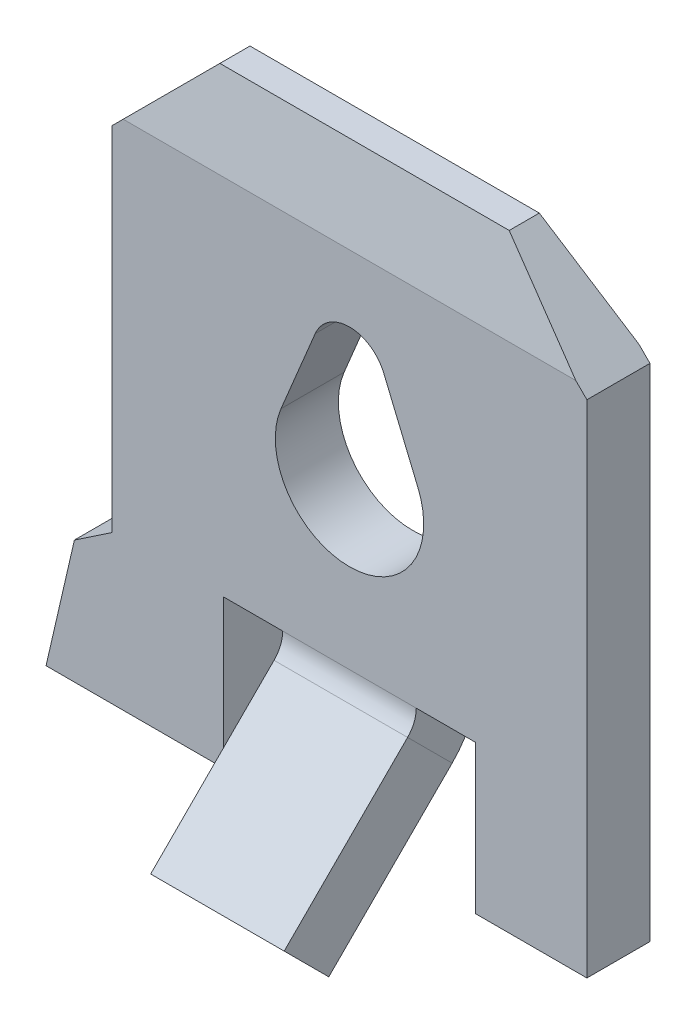
ISO-10303-21;
HEADER;
FILE_DESCRIPTION(('STEP AP214'),'2;1');
FILE_NAME('part.step','',(''),(''),'','','');
FILE_SCHEMA(('AUTOMOTIVE_DESIGN { 1 0 10303 214 1 1 1 1 }'));
ENDSEC;
DATA;
#1=APPLICATION_CONTEXT('core data for automotive mechanical design processes');
#2=APPLICATION_PROTOCOL_DEFINITION('international standard','automotive_design',2000,#1);
#3=PRODUCT_CONTEXT('',#1,'mechanical');
#4=PRODUCT('Part','Part','',(#3));
#5=PRODUCT_RELATED_PRODUCT_CATEGORY('part','',(#4));
#6=PRODUCT_DEFINITION_FORMATION('','',#4);
#7=PRODUCT_DEFINITION_CONTEXT('part definition',#1,'design');
#8=PRODUCT_DEFINITION('design','',#6,#7);
#9=PRODUCT_DEFINITION_SHAPE('','',#8);
#10=(LENGTH_UNIT() NAMED_UNIT(*) SI_UNIT(.MILLI.,.METRE.));
#11=(NAMED_UNIT(*) PLANE_ANGLE_UNIT() SI_UNIT($,.RADIAN.));
#12=(NAMED_UNIT(*) SI_UNIT($,.STERADIAN.) SOLID_ANGLE_UNIT());
#13=UNCERTAINTY_MEASURE_WITH_UNIT(LENGTH_MEASURE(1.E-05),#10,'distance_accuracy_value','');
#14=(GEOMETRIC_REPRESENTATION_CONTEXT(3) GLOBAL_UNCERTAINTY_ASSIGNED_CONTEXT((#13)) GLOBAL_UNIT_ASSIGNED_CONTEXT((#10,
#11,#12)) REPRESENTATION_CONTEXT('',''));
#15=CARTESIAN_POINT('',(0.,0.,0.));
#16=DIRECTION('',(0.,0.,1.));
#17=DIRECTION('',(1.,0.,0.));
#18=AXIS2_PLACEMENT_3D('',#15,#16,#17);
#19=CARTESIAN_POINT('',(6.4,0.149999999999999,0.));
#20=DIRECTION('',(0.,0.,1.));
#21=DIRECTION('',(0.,-1.,0.));
#22=AXIS2_PLACEMENT_3D('',#19,#20,#21);
#23=PLANE('',#22);
#24=DIRECTION('',(0.384813689288075,-0.922994271128755,0.));
#25=VECTOR('',#24,1.);
#26=CARTESIAN_POINT('',(3.66743697464802,5.82748992853653,0.));
#27=LINE('',#26,#25);
#28=CARTESIAN_POINT('',(3.66743697464802,5.82748992853653,0.));
#29=VERTEX_POINT('',#28);
#30=CARTESIAN_POINT('',(4.12299427112875,4.73481368928808,0.));
#31=VERTEX_POINT('',#30);
#32=EDGE_CURVE('E308',#29,#31,#27,.T.);
#33=ORIENTED_EDGE('',*,*,#32,.F.);
#34=CARTESIAN_POINT('',(3.2,5.65,0.));
#35=DIRECTION('',(0.,0.,1.));
#36=DIRECTION('',(0.,-1.,0.));
#37=AXIS2_PLACEMENT_3D('',#34,#35,#36);
#38=CIRCLE('',#37,0.5);
#39=CARTESIAN_POINT('',(2.73846153846154,5.84230769230769,0.));
#40=VERTEX_POINT('',#39);
#41=EDGE_CURVE('E311',#40,#29,#38,.F.);
#42=ORIENTED_EDGE('',*,*,#41,.F.);
#43=DIRECTION('',(0.384615384615385,0.923076923076923,0.));
#44=VECTOR('',#43,1.);
#45=CARTESIAN_POINT('',(2.73846153846154,5.84230769230769,0.));
#46=LINE('',#45,#44);
#47=CARTESIAN_POINT('',(2.27692307692308,4.73461538461538,0.));
#48=VERTEX_POINT('',#47);
#49=EDGE_CURVE('E313',#48,#40,#46,.T.);
#50=ORIENTED_EDGE('',*,*,#49,.F.);
#51=CARTESIAN_POINT('',(3.2,4.35,0.));
#52=DIRECTION('',(0.,0.,1.));
#53=DIRECTION('',(0.,-1.,0.));
#54=AXIS2_PLACEMENT_3D('',#51,#52,#53);
#55=CIRCLE('',#54,0.999999999999999);
#56=EDGE_CURVE('E305',#31,#48,#55,.F.);
#57=ORIENTED_EDGE('',*,*,#56,.F.);
#58=EDGE_LOOP('',(#33,#42,#50,#57));
#59=FACE_BOUND('',#58,.T.);
#60=DIRECTION('',(1.,0.,0.));
#61=VECTOR('',#60,1.);
#62=CARTESIAN_POINT('',(4.1,2.15,0.));
#63=LINE('',#62,#61);
#64=CARTESIAN_POINT('',(4.1,2.15,0.));
#65=VERTEX_POINT('',#64);
#66=CARTESIAN_POINT('',(4.9,2.15,0.));
#67=VERTEX_POINT('',#66);
#68=EDGE_CURVE('E272',#65,#67,#63,.T.);
#69=ORIENTED_EDGE('',*,*,#68,.F.);
#70=DIRECTION('',(-1.,0.,0.));
#71=VECTOR('',#70,1.);
#72=CARTESIAN_POINT('',(6.4,2.15000000000001,0.));
#73=LINE('',#72,#71);
#74=CARTESIAN_POINT('',(2.3,2.15,0.));
#75=VERTEX_POINT('',#74);
#76=EDGE_CURVE('E47',#65,#75,#73,.T.);
#77=ORIENTED_EDGE('',*,*,#76,.T.);
#78=DIRECTION('',(1.,0.,0.));
#79=VECTOR('',#78,1.);
#80=CARTESIAN_POINT('',(2.3,2.15,0.));
#81=LINE('',#80,#79);
#82=CARTESIAN_POINT('',(1.5,2.15,0.));
#83=VERTEX_POINT('',#82);
#84=EDGE_CURVE('E283',#83,#75,#81,.T.);
#85=ORIENTED_EDGE('',*,*,#84,.F.);
#86=DIRECTION('',(0.,1.,0.));
#87=VECTOR('',#86,1.);
#88=CARTESIAN_POINT('',(1.5,2.15,0.));
#89=LINE('',#88,#87);
#90=CARTESIAN_POINT('',(1.5,0.149999999999999,0.));
#91=VERTEX_POINT('',#90);
#92=EDGE_CURVE('E280',#91,#83,#89,.T.);
#93=ORIENTED_EDGE('',*,*,#92,.F.);
#94=DIRECTION('',(-1.,0.,0.));
#95=VECTOR('',#94,1.);
#96=CARTESIAN_POINT('',(6.4,0.149999999999999,0.));
#97=LINE('',#96,#95);
#98=CARTESIAN_POINT('',(-0.890356386047537,0.149999999999999,0.));
#99=VERTEX_POINT('',#98);
#100=EDGE_CURVE('E377',#91,#99,#97,.T.);
#101=ORIENTED_EDGE('',*,*,#100,.T.);
#102=DIRECTION('',(0.224692209858573,0.974429787531596,0.));
#103=VECTOR('',#102,1.);
#104=CARTESIAN_POINT('',(-0.507898340442458,1.80861785930754,0.));
#105=LINE('',#104,#103);
#106=CARTESIAN_POINT('',(-0.507898340442458,1.80861785930754,0.));
#107=VERTEX_POINT('',#106);
#108=EDGE_CURVE('E226',#99,#107,#105,.T.);
#109=ORIENTED_EDGE('',*,*,#108,.T.);
#110=DIRECTION('',(0.829945240760084,0.557844868525011,0.));
#111=VECTOR('',#110,1.);
#112=CARTESIAN_POINT('',(0.,2.15,0.));
#113=LINE('',#112,#111);
#114=CARTESIAN_POINT('',(0.,2.15,0.));
#115=VERTEX_POINT('',#114);
#116=EDGE_CURVE('E204',#107,#115,#113,.T.);
#117=ORIENTED_EDGE('',*,*,#116,.T.);
#118=DIRECTION('',(0.,1.,0.));
#119=VECTOR('',#118,1.);
#120=CARTESIAN_POINT('',(0.,0.149999999999999,0.));
#121=LINE('',#120,#119);
#122=CARTESIAN_POINT('',(0.,6.9,0.));
#123=VERTEX_POINT('',#122);
#124=EDGE_CURVE('E367',#115,#123,#121,.T.);
#125=ORIENTED_EDGE('',*,*,#124,.T.);
#126=DIRECTION('',(-0.707106781186548,-0.707106781186548,0.));
#127=VECTOR('',#126,1.);
#128=CARTESIAN_POINT('',(0.,6.9,0.));
#129=LINE('',#128,#127);
#130=CARTESIAN_POINT('',(0.150000000000001,7.05,0.));
#131=VERTEX_POINT('',#130);
#132=EDGE_CURVE('E341',#131,#123,#129,.T.);
#133=ORIENTED_EDGE('',*,*,#132,.F.);
#134=DIRECTION('',(-1.,0.,0.));
#135=VECTOR('',#134,1.);
#136=CARTESIAN_POINT('',(6.4,7.05,0.));
#137=LINE('',#136,#135);
#138=CARTESIAN_POINT('',(6.25,7.05,0.));
#139=VERTEX_POINT('',#138);
#140=EDGE_CURVE('E372',#139,#131,#137,.T.);
#141=ORIENTED_EDGE('',*,*,#140,.F.);
#142=DIRECTION('',(-0.707106781186548,0.707106781186548,0.));
#143=VECTOR('',#142,1.);
#144=CARTESIAN_POINT('',(5.15,8.15,0.));
#145=LINE('',#144,#143);
#146=CARTESIAN_POINT('',(6.4,6.9,0.));
#147=VERTEX_POINT('',#146);
#148=EDGE_CURVE('E337',#147,#139,#145,.T.);
#149=ORIENTED_EDGE('',*,*,#148,.F.);
#150=DIRECTION('',(0.,1.,0.));
#151=VECTOR('',#150,1.);
#152=CARTESIAN_POINT('',(6.4,0.149999999999999,0.));
#153=LINE('',#152,#151);
#154=CARTESIAN_POINT('',(6.4,0.149999999999999,0.));
#155=VERTEX_POINT('',#154);
#156=EDGE_CURVE('E369',#155,#147,#153,.T.);
#157=ORIENTED_EDGE('',*,*,#156,.F.);
#158=CARTESIAN_POINT('',(4.9,0.149999999999999,0.));
#159=VERTEX_POINT('',#158);
#160=EDGE_CURVE('E378',#155,#159,#97,.T.);
#161=ORIENTED_EDGE('',*,*,#160,.T.);
#162=DIRECTION('',(0.,-1.,0.));
#163=VECTOR('',#162,1.);
#164=CARTESIAN_POINT('',(4.9,2.15,0.));
#165=LINE('',#164,#163);
#166=EDGE_CURVE('E297',#67,#159,#165,.T.);
#167=ORIENTED_EDGE('',*,*,#166,.F.);
#168=EDGE_LOOP('',(#69,#77,#85,#93,#101,#109,#117,#125,#133,#141,#149,#157,#161,#167));
#169=FACE_BOUND('',#168,.T.);
#170=ADVANCED_FACE('F40',(#59,#169),#23,.F.);
#171=CARTESIAN_POINT('',(6.4,7.05,0.85));
#172=DIRECTION('',(0.,0.,-1.));
#173=DIRECTION('',(0.,1.,0.));
#174=AXIS2_PLACEMENT_3D('',#171,#172,#173);
#175=PLANE('',#174);
#176=DIRECTION('',(-0.384615384615385,-0.923076923076923,0.));
#177=VECTOR('',#176,1.);
#178=CARTESIAN_POINT('',(2.73846153846154,5.84230769230769,0.849999999999999));
#179=LINE('',#178,#177);
#180=CARTESIAN_POINT('',(2.73846153846154,5.84230769230769,0.85));
#181=VERTEX_POINT('',#180);
#182=CARTESIAN_POINT('',(2.27692307692308,4.73461538461538,0.849999999999999));
#183=VERTEX_POINT('',#182);
#184=EDGE_CURVE('E315',#181,#183,#179,.T.);
#185=ORIENTED_EDGE('',*,*,#184,.F.);
#186=CARTESIAN_POINT('',(3.2,5.65,0.849999999999999));
#187=DIRECTION('',(0.,0.,1.));
#188=DIRECTION('',(1.,0.,0.));
#189=AXIS2_PLACEMENT_3D('',#186,#187,#188);
#190=CIRCLE('',#189,0.5);
#191=CARTESIAN_POINT('',(3.66743697464802,5.82748992853653,0.849999999999999));
#192=VERTEX_POINT('',#191);
#193=EDGE_CURVE('E291',#192,#181,#190,.T.);
#194=ORIENTED_EDGE('',*,*,#193,.F.);
#195=DIRECTION('',(-0.384813689288075,0.922994271128755,0.));
#196=VECTOR('',#195,1.);
#197=CARTESIAN_POINT('',(3.66743697464802,5.82748992853653,0.849999999999999));
#198=LINE('',#197,#196);
#199=CARTESIAN_POINT('',(4.12299427112875,4.73481368928808,0.849999999999999));
#200=VERTEX_POINT('',#199);
#201=EDGE_CURVE('E321',#200,#192,#198,.T.);
#202=ORIENTED_EDGE('',*,*,#201,.F.);
#203=CARTESIAN_POINT('',(3.2,4.35,0.849999999999999));
#204=DIRECTION('',(0.,0.,1.));
#205=DIRECTION('',(1.,0.,0.));
#206=AXIS2_PLACEMENT_3D('',#203,#204,#205);
#207=CIRCLE('',#206,0.999999999999999);
#208=EDGE_CURVE('E318',#183,#200,#207,.T.);
#209=ORIENTED_EDGE('',*,*,#208,.F.);
#210=EDGE_LOOP('',(#185,#194,#202,#209));
#211=FACE_BOUND('',#210,.T.);
#212=DIRECTION('',(-1.,0.,0.));
#213=VECTOR('',#212,1.);
#214=CARTESIAN_POINT('',(2.3,2.15,0.85));
#215=LINE('',#214,#213);
#216=CARTESIAN_POINT('',(2.3,2.15,0.85));
#217=VERTEX_POINT('',#216);
#218=CARTESIAN_POINT('',(1.5,2.15,0.85));
#219=VERTEX_POINT('',#218);
#220=EDGE_CURVE('E276',#217,#219,#215,.T.);
#221=ORIENTED_EDGE('',*,*,#220,.F.);
#222=DIRECTION('',(1.,0.,0.));
#223=VECTOR('',#222,1.);
#224=CARTESIAN_POINT('',(6.4,2.15,0.849999999999999));
#225=LINE('',#224,#223);
#226=CARTESIAN_POINT('',(4.1,2.15,0.85));
#227=VERTEX_POINT('',#226);
#228=EDGE_CURVE('E394',#217,#227,#225,.T.);
#229=ORIENTED_EDGE('',*,*,#228,.T.);
#230=DIRECTION('',(-1.,0.,0.));
#231=VECTOR('',#230,1.);
#232=CARTESIAN_POINT('',(4.1,2.15,0.85));
#233=LINE('',#232,#231);
#234=CARTESIAN_POINT('',(4.9,2.15,0.85));
#235=VERTEX_POINT('',#234);
#236=EDGE_CURVE('E284',#235,#227,#233,.T.);
#237=ORIENTED_EDGE('',*,*,#236,.F.);
#238=DIRECTION('',(0.,1.,0.));
#239=VECTOR('',#238,1.);
#240=CARTESIAN_POINT('',(4.9,2.15,0.85));
#241=LINE('',#240,#239);
#242=CARTESIAN_POINT('',(4.9,0.149999999999999,0.849999999999999));
#243=VERTEX_POINT('',#242);
#244=EDGE_CURVE('E292',#243,#235,#241,.T.);
#245=ORIENTED_EDGE('',*,*,#244,.F.);
#246=DIRECTION('',(-1.,0.,0.));
#247=VECTOR('',#246,1.);
#248=CARTESIAN_POINT('',(6.4,0.149999999999999,0.849999999999999));
#249=LINE('',#248,#247);
#250=CARTESIAN_POINT('',(6.4,0.149999999999999,0.849999999999999));
#251=VERTEX_POINT('',#250);
#252=EDGE_CURVE('E382',#251,#243,#249,.T.);
#253=ORIENTED_EDGE('',*,*,#252,.F.);
#254=DIRECTION('',(0.,-1.,0.));
#255=VECTOR('',#254,1.);
#256=CARTESIAN_POINT('',(6.4,7.05,0.85));
#257=LINE('',#256,#255);
#258=CARTESIAN_POINT('',(6.4,6.9,0.85));
#259=VERTEX_POINT('',#258);
#260=EDGE_CURVE('E364',#259,#251,#257,.T.);
#261=ORIENTED_EDGE('',*,*,#260,.F.);
#262=DIRECTION('',(0.707106781186548,-0.707106781186548,0.));
#263=VECTOR('',#262,1.);
#264=CARTESIAN_POINT('',(5.15,8.15,0.849999999999999));
#265=LINE('',#264,#263);
#266=CARTESIAN_POINT('',(6.25,7.05,0.849999999999999));
#267=VERTEX_POINT('',#266);
#268=EDGE_CURVE('E333',#267,#259,#265,.T.);
#269=ORIENTED_EDGE('',*,*,#268,.F.);
#270=DIRECTION('',(-1.,0.,0.));
#271=VECTOR('',#270,1.);
#272=CARTESIAN_POINT('',(6.4,7.05,0.85));
#273=LINE('',#272,#271);
#274=CARTESIAN_POINT('',(0.15,7.05,0.849999999999999));
#275=VERTEX_POINT('',#274);
#276=EDGE_CURVE('E385',#267,#275,#273,.T.);
#277=ORIENTED_EDGE('',*,*,#276,.T.);
#278=DIRECTION('',(0.707106781186547,0.707106781186548,0.));
#279=VECTOR('',#278,1.);
#280=CARTESIAN_POINT('',(0.,6.9,0.849999999999999));
#281=LINE('',#280,#279);
#282=CARTESIAN_POINT('',(0.,6.9,0.849999999999999));
#283=VERTEX_POINT('',#282);
#284=EDGE_CURVE('E334',#283,#275,#281,.T.);
#285=ORIENTED_EDGE('',*,*,#284,.F.);
#286=DIRECTION('',(0.,-1.,0.));
#287=VECTOR('',#286,1.);
#288=CARTESIAN_POINT('',(0.,7.05,0.85));
#289=LINE('',#288,#287);
#290=CARTESIAN_POINT('',(0.,2.15,0.849999999999999));
#291=VERTEX_POINT('',#290);
#292=EDGE_CURVE('E223',#283,#291,#289,.T.);
#293=ORIENTED_EDGE('',*,*,#292,.T.);
#294=DIRECTION('',(-0.829945240760084,-0.557844868525011,0.));
#295=VECTOR('',#294,1.);
#296=CARTESIAN_POINT('',(0.,2.15,0.849999999999999));
#297=LINE('',#296,#295);
#298=CARTESIAN_POINT('',(-0.507898340442458,1.80861785930754,0.849999999999999));
#299=VERTEX_POINT('',#298);
#300=EDGE_CURVE('E54',#291,#299,#297,.T.);
#301=ORIENTED_EDGE('',*,*,#300,.T.);
#302=DIRECTION('',(-0.224692209858573,-0.974429787531596,0.));
#303=VECTOR('',#302,1.);
#304=CARTESIAN_POINT('',(-0.507898340442458,1.80861785930754,0.849999999999999));
#305=LINE('',#304,#303);
#306=CARTESIAN_POINT('',(-0.890356386047537,0.149999999999999,0.849999999999999));
#307=VERTEX_POINT('',#306);
#308=EDGE_CURVE('E212',#299,#307,#305,.T.);
#309=ORIENTED_EDGE('',*,*,#308,.T.);
#310=CARTESIAN_POINT('',(1.5,0.149999999999999,0.849999999999999));
#311=VERTEX_POINT('',#310);
#312=EDGE_CURVE('E381',#311,#307,#249,.T.);
#313=ORIENTED_EDGE('',*,*,#312,.F.);
#314=DIRECTION('',(0.,-1.,0.));
#315=VECTOR('',#314,1.);
#316=CARTESIAN_POINT('',(1.5,2.15,0.85));
#317=LINE('',#316,#315);
#318=EDGE_CURVE('E278',#219,#311,#317,.T.);
#319=ORIENTED_EDGE('',*,*,#318,.F.);
#320=EDGE_LOOP('',(#221,#229,#237,#245,#253,#261,#269,#277,#285,#293,#301,#309,#313,#319));
#321=FACE_BOUND('',#320,.T.);
#322=ADVANCED_FACE('F220',(#211,#321),#175,.F.);
#323=CARTESIAN_POINT('',(6.4,0.149999999999999,0.));
#324=DIRECTION('',(0.,1.,0.));
#325=DIRECTION('',(0.,0.,1.));
#326=AXIS2_PLACEMENT_3D('',#323,#324,#325);
#327=PLANE('',#326);
#328=ORIENTED_EDGE('',*,*,#100,.F.);
#329=DIRECTION('',(0.,0.,-1.));
#330=VECTOR('',#329,1.);
#331=CARTESIAN_POINT('',(1.5,0.149999999999999,3.0040659228538));
#332=LINE('',#331,#330);
#333=EDGE_CURVE('E287',#311,#91,#332,.T.);
#334=ORIENTED_EDGE('',*,*,#333,.F.);
#335=ORIENTED_EDGE('',*,*,#312,.T.);
#336=DIRECTION('',(0.,0.,1.));
#337=VECTOR('',#336,1.);
#338=CARTESIAN_POINT('',(-0.890356386047537,0.149999999999999,-2.18923148483106));
#339=LINE('',#338,#337);
#340=EDGE_CURVE('E207',#99,#307,#339,.T.);
#341=ORIENTED_EDGE('',*,*,#340,.F.);
#342=EDGE_LOOP('',(#328,#334,#335,#341));
#343=FACE_BOUND('',#342,.T.);
#344=ADVANCED_FACE('F452',(#343),#327,.F.);
#345=CARTESIAN_POINT('',(6.4,7.05,0.));
#346=DIRECTION('',(0.,-0.214348018272916,0.976757353216485));
#347=DIRECTION('',(0.,-0.976757353216485,-0.214348018272916));
#348=AXIS2_PLACEMENT_3D('',#345,#346,#347);
#349=PLANE('',#348);
#350=ORIENTED_EDGE('',*,*,#140,.T.);
#351=DIRECTION('',(0.698744344369524,0.698744344369524,0.153338457091523));
#352=VECTOR('',#351,1.);
#353=CARTESIAN_POINT('',(3.20152286742747,10.1015228674275,0.669652372919065));
#354=LINE('',#353,#352);
#355=CARTESIAN_POINT('',(1.25,8.15,0.241393442622949));
#356=VERTEX_POINT('',#355);
#357=EDGE_CURVE('E355',#131,#356,#354,.T.);
#358=ORIENTED_EDGE('',*,*,#357,.T.);
#359=DIRECTION('',(-1.,0.,0.));
#360=VECTOR('',#359,1.);
#361=CARTESIAN_POINT('',(6.4,8.15,0.241393442622949));
#362=LINE('',#361,#360);
#363=CARTESIAN_POINT('',(5.15,8.15,0.241393442622949));
#364=VERTEX_POINT('',#363);
#365=EDGE_CURVE('E391',#364,#356,#362,.T.);
#366=ORIENTED_EDGE('',*,*,#365,.F.);
#367=DIRECTION('',(0.698744344369524,-0.698744344369524,-0.153338457091523));
#368=VECTOR('',#367,1.);
#369=CARTESIAN_POINT('',(6.32323654881826,6.97676345118174,-0.0160716569500576));
#370=LINE('',#369,#368);
#371=EDGE_CURVE('E361',#364,#139,#370,.T.);
#372=ORIENTED_EDGE('',*,*,#371,.T.);
#373=EDGE_LOOP('',(#350,#358,#366,#372));
#374=FACE_BOUND('',#373,.T.);
#375=ADVANCED_FACE('F514',(#374),#349,.F.);
#376=CARTESIAN_POINT('',(6.4,8.15,0.241393442622949));
#377=DIRECTION('',(0.,-1.,0.));
#378=DIRECTION('',(0.,0.,-1.));
#379=AXIS2_PLACEMENT_3D('',#376,#377,#378);
#380=PLANE('',#379);
#381=ORIENTED_EDGE('',*,*,#365,.T.);
#382=DIRECTION('',(0.,0.,1.));
#383=VECTOR('',#382,1.);
#384=CARTESIAN_POINT('',(1.25,8.15,-1.76776695296637));
#385=LINE('',#384,#383);
#386=CARTESIAN_POINT('',(1.25,8.15,0.647131147540979));
#387=VERTEX_POINT('',#386);
#388=EDGE_CURVE('E338',#356,#387,#385,.T.);
#389=ORIENTED_EDGE('',*,*,#388,.T.);
#390=DIRECTION('',(-1.,0.,0.));
#391=VECTOR('',#390,1.);
#392=CARTESIAN_POINT('',(6.4,8.15,0.647131147540979));
#393=LINE('',#392,#391);
#394=CARTESIAN_POINT('',(5.15,8.15,0.647131147540979));
#395=VERTEX_POINT('',#394);
#396=EDGE_CURVE('E388',#395,#387,#393,.T.);
#397=ORIENTED_EDGE('',*,*,#396,.F.);
#398=DIRECTION('',(0.,0.,1.));
#399=VECTOR('',#398,1.);
#400=CARTESIAN_POINT('',(5.15,8.15,-1.76776695296637));
#401=LINE('',#400,#399);
#402=EDGE_CURVE('E347',#364,#395,#401,.T.);
#403=ORIENTED_EDGE('',*,*,#402,.F.);
#404=EDGE_LOOP('',(#381,#389,#397,#403));
#405=FACE_BOUND('',#404,.T.);
#406=ADVANCED_FACE('F510',(#405),#380,.F.);
#407=CARTESIAN_POINT('',(6.4,8.15,0.647131147540979));
#408=DIRECTION('',(0.,-0.181367589437408,-0.983415373838372));
#409=DIRECTION('',(0.,0.983415373838372,-0.181367589437408));
#410=AXIS2_PLACEMENT_3D('',#407,#408,#409);
#411=PLANE('',#410);
#412=ORIENTED_EDGE('',*,*,#396,.T.);
#413=DIRECTION('',(-0.70116968993079,-0.70116968993079,0.12931408215937));
#414=VECTOR('',#413,1.);
#415=CARTESIAN_POINT('',(3.78194051049985,10.6819405104998,0.180174905850425));
#416=LINE('',#415,#414);
#417=EDGE_CURVE('E345',#387,#275,#416,.T.);
#418=ORIENTED_EDGE('',*,*,#417,.T.);
#419=ORIENTED_EDGE('',*,*,#276,.F.);
#420=DIRECTION('',(-0.70116968993079,0.70116968993079,-0.12931408215937));
#421=VECTOR('',#420,1.);
#422=CARTESIAN_POINT('',(5.76454866759705,7.53545133240295,0.760470041155192));
#423=LINE('',#422,#421);
#424=EDGE_CURVE('E358',#267,#395,#423,.T.);
#425=ORIENTED_EDGE('',*,*,#424,.T.);
#426=EDGE_LOOP('',(#412,#418,#419,#425));
#427=FACE_BOUND('',#426,.T.);
#428=ADVANCED_FACE('F506',(#427),#411,.F.);
#429=ORIENTED_EDGE('',*,*,#252,.T.);
#430=DIRECTION('',(0.,0.,-1.));
#431=VECTOR('',#430,1.);
#432=CARTESIAN_POINT('',(4.9,0.149999999999999,3.0040659228538));
#433=LINE('',#432,#431);
#434=EDGE_CURVE('E294',#243,#159,#433,.T.);
#435=ORIENTED_EDGE('',*,*,#434,.T.);
#436=ORIENTED_EDGE('',*,*,#160,.F.);
#437=DIRECTION('',(0.,0.,-1.));
#438=VECTOR('',#437,1.);
#439=CARTESIAN_POINT('',(6.4,0.149999999999999,0.));
#440=LINE('',#439,#438);
#441=EDGE_CURVE('E366',#251,#155,#440,.T.);
#442=ORIENTED_EDGE('',*,*,#441,.F.);
#443=EDGE_LOOP('',(#429,#435,#436,#442));
#444=FACE_BOUND('',#443,.T.);
#445=ADVANCED_FACE('F499',(#444),#327,.F.);
#446=CARTESIAN_POINT('',(6.4,0.,0.));
#447=DIRECTION('',(1.,0.,0.));
#448=DIRECTION('',(0.,0.,-1.));
#449=AXIS2_PLACEMENT_3D('',#446,#447,#448);
#450=PLANE('',#449);
#451=DIRECTION('',(0.,0.,1.));
#452=VECTOR('',#451,1.);
#453=CARTESIAN_POINT('',(6.4,6.9,-1.76776695296637));
#454=LINE('',#453,#452);
#455=EDGE_CURVE('E348',#147,#259,#454,.T.);
#456=ORIENTED_EDGE('',*,*,#455,.T.);
#457=ORIENTED_EDGE('',*,*,#260,.T.);
#458=ORIENTED_EDGE('',*,*,#441,.T.);
#459=ORIENTED_EDGE('',*,*,#156,.T.);
#460=EDGE_LOOP('',(#456,#457,#458,#459));
#461=FACE_BOUND('',#460,.T.);
#462=ADVANCED_FACE('F496',(#461),#450,.T.);
#463=CARTESIAN_POINT('',(0.,0.,0.));
#464=DIRECTION('',(1.,0.,0.));
#465=DIRECTION('',(0.,0.,-1.));
#466=AXIS2_PLACEMENT_3D('',#463,#464,#465);
#467=PLANE('',#466);
#468=ORIENTED_EDGE('',*,*,#124,.F.);
#469=DIRECTION('',(0.,0.,1.));
#470=VECTOR('',#469,1.);
#471=CARTESIAN_POINT('',(0.,2.15,-2.18923148483106));
#472=LINE('',#471,#470);
#473=EDGE_CURVE('E208',#115,#291,#472,.T.);
#474=ORIENTED_EDGE('',*,*,#473,.T.);
#475=ORIENTED_EDGE('',*,*,#292,.F.);
#476=DIRECTION('',(0.,0.,1.));
#477=VECTOR('',#476,1.);
#478=CARTESIAN_POINT('',(0.,6.9,-1.76776695296637));
#479=LINE('',#478,#477);
#480=EDGE_CURVE('E336',#123,#283,#479,.T.);
#481=ORIENTED_EDGE('',*,*,#480,.F.);
#482=EDGE_LOOP('',(#468,#474,#475,#481));
#483=FACE_BOUND('',#482,.T.);
#484=ADVANCED_FACE('F491',(#483),#467,.F.);
#485=CARTESIAN_POINT('',(0.,6.9,-1.76776695296637));
#486=DIRECTION('',(0.707106781186548,-0.707106781186548,0.));
#487=DIRECTION('',(0.707106781186548,0.707106781186548,0.));
#488=AXIS2_PLACEMENT_3D('',#485,#486,#487);
#489=PLANE('',#488);
#490=ORIENTED_EDGE('',*,*,#132,.T.);
#491=ORIENTED_EDGE('',*,*,#480,.T.);
#492=ORIENTED_EDGE('',*,*,#284,.T.);
#493=ORIENTED_EDGE('',*,*,#417,.F.);
#494=ORIENTED_EDGE('',*,*,#388,.F.);
#495=ORIENTED_EDGE('',*,*,#357,.F.);
#496=EDGE_LOOP('',(#490,#491,#492,#493,#494,#495));
#497=FACE_BOUND('',#496,.T.);
#498=ADVANCED_FACE('F488',(#497),#489,.F.);
#499=CARTESIAN_POINT('',(5.15,8.15,-1.76776695296637));
#500=DIRECTION('',(-0.707106781186547,-0.707106781186547,0.));
#501=DIRECTION('',(0.707106781186548,-0.707106781186548,0.));
#502=AXIS2_PLACEMENT_3D('',#499,#500,#501);
#503=PLANE('',#502);
#504=ORIENTED_EDGE('',*,*,#402,.T.);
#505=ORIENTED_EDGE('',*,*,#424,.F.);
#506=ORIENTED_EDGE('',*,*,#268,.T.);
#507=ORIENTED_EDGE('',*,*,#455,.F.);
#508=ORIENTED_EDGE('',*,*,#148,.T.);
#509=ORIENTED_EDGE('',*,*,#371,.F.);
#510=EDGE_LOOP('',(#504,#505,#506,#507,#508,#509));
#511=FACE_BOUND('',#510,.T.);
#512=ADVANCED_FACE('F487',(#511),#503,.F.);
#513=CARTESIAN_POINT('',(3.2,5.65,-3.44093010681705));
#514=DIRECTION('',(0.,0.,1.));
#515=DIRECTION('',(1.,0.,0.));
#516=AXIS2_PLACEMENT_3D('',#513,#514,#515);
#517=CYLINDRICAL_SURFACE('',#516,0.5);
#518=ORIENTED_EDGE('',*,*,#41,.T.);
#519=DIRECTION('',(0.,0.,1.));
#520=VECTOR('',#519,1.);
#521=CARTESIAN_POINT('',(3.66743697464802,5.82748992853653,-3.44093010681705));
#522=LINE('',#521,#520);
#523=EDGE_CURVE('E309',#29,#192,#522,.T.);
#524=ORIENTED_EDGE('',*,*,#523,.T.);
#525=ORIENTED_EDGE('',*,*,#193,.T.);
#526=DIRECTION('',(0.,0.,1.));
#527=VECTOR('',#526,1.);
#528=CARTESIAN_POINT('',(2.73846153846154,5.84230769230769,-3.44093010681705));
#529=LINE('',#528,#527);
#530=EDGE_CURVE('E324',#40,#181,#529,.T.);
#531=ORIENTED_EDGE('',*,*,#530,.F.);
#532=EDGE_LOOP('',(#518,#524,#525,#531));
#533=FACE_BOUND('',#532,.T.);
#534=ADVANCED_FACE('F470',(#533),#517,.F.);
#535=CARTESIAN_POINT('',(3.66743697464802,5.82748992853653,-3.44093010681705));
#536=DIRECTION('',(0.922994271128755,0.384813689288075,0.));
#537=DIRECTION('',(-0.384813689288075,0.922994271128755,0.));
#538=AXIS2_PLACEMENT_3D('',#535,#536,#537);
#539=PLANE('',#538);
#540=ORIENTED_EDGE('',*,*,#32,.T.);
#541=DIRECTION('',(0.,0.,1.));
#542=VECTOR('',#541,1.);
#543=CARTESIAN_POINT('',(4.12299427112875,4.73481368928808,-3.44093010681705));
#544=LINE('',#543,#542);
#545=EDGE_CURVE('E326',#31,#200,#544,.T.);
#546=ORIENTED_EDGE('',*,*,#545,.T.);
#547=ORIENTED_EDGE('',*,*,#201,.T.);
#548=ORIENTED_EDGE('',*,*,#523,.F.);
#549=EDGE_LOOP('',(#540,#546,#547,#548));
#550=FACE_BOUND('',#549,.T.);
#551=ADVANCED_FACE('F461',(#550),#539,.F.);
#552=CARTESIAN_POINT('',(3.2,4.35,-3.44093010681705));
#553=DIRECTION('',(0.,0.,1.));
#554=DIRECTION('',(1.,0.,0.));
#555=AXIS2_PLACEMENT_3D('',#552,#553,#554);
#556=CYLINDRICAL_SURFACE('',#555,0.999999999999999);
#557=ORIENTED_EDGE('',*,*,#56,.T.);
#558=DIRECTION('',(0.,0.,1.));
#559=VECTOR('',#558,1.);
#560=CARTESIAN_POINT('',(2.27692307692308,4.73461538461538,-3.44093010681705));
#561=LINE('',#560,#559);
#562=EDGE_CURVE('E328',#48,#183,#561,.T.);
#563=ORIENTED_EDGE('',*,*,#562,.T.);
#564=ORIENTED_EDGE('',*,*,#208,.T.);
#565=ORIENTED_EDGE('',*,*,#545,.F.);
#566=EDGE_LOOP('',(#557,#563,#564,#565));
#567=FACE_BOUND('',#566,.T.);
#568=ADVANCED_FACE('F463',(#567),#556,.F.);
#569=CARTESIAN_POINT('',(2.73846153846154,5.84230769230769,-3.44093010681705));
#570=DIRECTION('',(-0.923076923076923,0.384615384615385,0.));
#571=DIRECTION('',(-0.384615384615385,-0.923076923076923,0.));
#572=AXIS2_PLACEMENT_3D('',#569,#570,#571);
#573=PLANE('',#572);
#574=ORIENTED_EDGE('',*,*,#49,.T.);
#575=ORIENTED_EDGE('',*,*,#530,.T.);
#576=ORIENTED_EDGE('',*,*,#184,.T.);
#577=ORIENTED_EDGE('',*,*,#562,.F.);
#578=EDGE_LOOP('',(#574,#575,#576,#577));
#579=FACE_BOUND('',#578,.T.);
#580=ADVANCED_FACE('F472',(#579),#573,.F.);
#581=CARTESIAN_POINT('',(4.9,2.15,3.0040659228538));
#582=DIRECTION('',(1.,0.,0.));
#583=DIRECTION('',(0.,1.,0.));
#584=AXIS2_PLACEMENT_3D('',#581,#582,#583);
#585=PLANE('',#584);
#586=ORIENTED_EDGE('',*,*,#244,.T.);
#587=DIRECTION('',(0.,0.,-1.));
#588=VECTOR('',#587,1.);
#589=CARTESIAN_POINT('',(4.9,2.15,3.0040659228538));
#590=LINE('',#589,#588);
#591=EDGE_CURVE('E299',#235,#67,#590,.T.);
#592=ORIENTED_EDGE('',*,*,#591,.T.);
#593=ORIENTED_EDGE('',*,*,#166,.T.);
#594=ORIENTED_EDGE('',*,*,#434,.F.);
#595=EDGE_LOOP('',(#586,#592,#593,#594));
#596=FACE_BOUND('',#595,.T.);
#597=ADVANCED_FACE('F474',(#596),#585,.F.);
#598=CARTESIAN_POINT('',(4.1,2.15,3.0040659228538));
#599=DIRECTION('',(0.,1.,0.));
#600=DIRECTION('',(-1.,0.,0.));
#601=AXIS2_PLACEMENT_3D('',#598,#599,#600);
#602=PLANE('',#601);
#603=ORIENTED_EDGE('',*,*,#236,.T.);
#604=DIRECTION('',(0.,0.,-1.));
#605=VECTOR('',#604,1.);
#606=CARTESIAN_POINT('',(4.1,2.15,3.0040659228538));
#607=LINE('',#606,#605);
#608=EDGE_CURVE('E12',#227,#65,#607,.T.);
#609=ORIENTED_EDGE('',*,*,#608,.T.);
#610=ORIENTED_EDGE('',*,*,#68,.T.);
#611=ORIENTED_EDGE('',*,*,#591,.F.);
#612=EDGE_LOOP('',(#603,#609,#610,#611));
#613=FACE_BOUND('',#612,.T.);
#614=ADVANCED_FACE('F405',(#613),#602,.F.);
#615=CARTESIAN_POINT('',(2.3,2.15,3.0040659228538));
#616=DIRECTION('',(0.,1.,0.));
#617=DIRECTION('',(0.,0.,1.));
#618=AXIS2_PLACEMENT_3D('',#615,#616,#617);
#619=PLANE('',#618);
#620=ORIENTED_EDGE('',*,*,#220,.T.);
#621=DIRECTION('',(0.,0.,-1.));
#622=VECTOR('',#621,1.);
#623=CARTESIAN_POINT('',(1.5,2.15,3.0040659228538));
#624=LINE('',#623,#622);
#625=EDGE_CURVE('E279',#219,#83,#624,.T.);
#626=ORIENTED_EDGE('',*,*,#625,.T.);
#627=ORIENTED_EDGE('',*,*,#84,.T.);
#628=DIRECTION('',(0.,0.,-1.));
#629=VECTOR('',#628,1.);
#630=CARTESIAN_POINT('',(2.3,2.15,3.0040659228538));
#631=LINE('',#630,#629);
#632=EDGE_CURVE('E397',#217,#75,#631,.T.);
#633=ORIENTED_EDGE('',*,*,#632,.F.);
#634=EDGE_LOOP('',(#620,#626,#627,#633));
#635=FACE_BOUND('',#634,.T.);
#636=ADVANCED_FACE('F418',(#635),#619,.F.);
#637=CARTESIAN_POINT('',(1.5,2.15,3.0040659228538));
#638=DIRECTION('',(-1.,0.,0.));
#639=DIRECTION('',(0.,-1.,0.));
#640=AXIS2_PLACEMENT_3D('',#637,#638,#639);
#641=PLANE('',#640);
#642=ORIENTED_EDGE('',*,*,#318,.T.);
#643=ORIENTED_EDGE('',*,*,#333,.T.);
#644=ORIENTED_EDGE('',*,*,#92,.T.);
#645=ORIENTED_EDGE('',*,*,#625,.F.);
#646=EDGE_LOOP('',(#642,#643,#644,#645));
#647=FACE_BOUND('',#646,.T.);
#648=ADVANCED_FACE('F540',(#647),#641,.F.);
#649=CARTESIAN_POINT('',(2.3,2.15,1.25));
#650=DIRECTION('',(1.,0.,0.));
#651=DIRECTION('',(0.,0.,-1.));
#652=AXIS2_PLACEMENT_3D('',#649,#650,#651);
#653=PLANE('',#652);
#654=ORIENTED_EDGE('',*,*,#632,.T.);
#655=CARTESIAN_POINT('',(2.3,2.15,1.25));
#656=DIRECTION('',(1.,0.,0.));
#657=DIRECTION('',(0.,1.,0.));
#658=AXIS2_PLACEMENT_3D('',#655,#656,#657);
#659=CIRCLE('',#658,1.25);
#660=CARTESIAN_POINT('',(2.3,1.26611652351682,0.366116523516817));
#661=VERTEX_POINT('',#660);
#662=EDGE_CURVE('E234',#75,#661,#659,.F.);
#663=ORIENTED_EDGE('',*,*,#662,.T.);
#664=DIRECTION('',(0.,0.707106781186544,0.707106781186551));
#665=VECTOR('',#664,1.);
#666=CARTESIAN_POINT('',(2.3,3.39031190869815,2.49031190869817));
#667=LINE('',#666,#665);
#668=CARTESIAN_POINT('',(2.3,1.86715728752538,0.967157287525381));
#669=VERTEX_POINT('',#668);
#670=EDGE_CURVE('E254',#661,#669,#667,.T.);
#671=ORIENTED_EDGE('',*,*,#670,.T.);
#672=CARTESIAN_POINT('',(2.3,2.15,1.25));
#673=DIRECTION('',(-1.,0.,0.));
#674=DIRECTION('',(0.,0.,-1.));
#675=AXIS2_PLACEMENT_3D('',#672,#673,#674);
#676=CIRCLE('',#675,0.4);
#677=EDGE_CURVE('E265',#217,#669,#676,.T.);
#678=ORIENTED_EDGE('',*,*,#677,.F.);
#679=EDGE_LOOP('',(#654,#663,#671,#678));
#680=FACE_BOUND('',#679,.T.);
#681=ADVANCED_FACE('F420',(#680),#653,.F.);
#682=CARTESIAN_POINT('',(4.1,2.15,1.25));
#683=DIRECTION('',(-1.,0.,0.));
#684=DIRECTION('',(0.,0.,1.));
#685=AXIS2_PLACEMENT_3D('',#682,#683,#684);
#686=PLANE('',#685);
#687=DIRECTION('',(0.,-0.707106781186544,-0.707106781186551));
#688=VECTOR('',#687,1.);
#689=CARTESIAN_POINT('',(4.1,3.39031190869815,2.49031190869817));
#690=LINE('',#689,#688);
#691=CARTESIAN_POINT('',(4.1,1.86715728752538,0.96715728752538));
#692=VERTEX_POINT('',#691);
#693=CARTESIAN_POINT('',(4.1,1.26611652351682,0.366116523516817));
#694=VERTEX_POINT('',#693);
#695=EDGE_CURVE('E260',#692,#694,#690,.T.);
#696=ORIENTED_EDGE('',*,*,#695,.T.);
#697=CARTESIAN_POINT('',(4.1,2.15,1.25));
#698=DIRECTION('',(1.,0.,0.));
#699=DIRECTION('',(0.,1.,0.));
#700=AXIS2_PLACEMENT_3D('',#697,#698,#699);
#701=CIRCLE('',#700,1.25);
#702=EDGE_CURVE('E269',#694,#65,#701,.T.);
#703=ORIENTED_EDGE('',*,*,#702,.T.);
#704=ORIENTED_EDGE('',*,*,#608,.F.);
#705=CARTESIAN_POINT('',(4.1,2.15,1.25));
#706=DIRECTION('',(1.,0.,0.));
#707=DIRECTION('',(0.,0.,1.));
#708=AXIS2_PLACEMENT_3D('',#705,#706,#707);
#709=CIRCLE('',#708,0.4);
#710=EDGE_CURVE('E268',#692,#227,#709,.T.);
#711=ORIENTED_EDGE('',*,*,#710,.F.);
#712=EDGE_LOOP('',(#696,#703,#704,#711));
#713=FACE_BOUND('',#712,.T.);
#714=ADVANCED_FACE('F409',(#713),#686,.F.);
#715=CARTESIAN_POINT('',(1.10659518523812,2.15,1.25));
#716=DIRECTION('',(1.,0.,0.));
#717=DIRECTION('',(0.,1.,0.));
#718=AXIS2_PLACEMENT_3D('',#715,#716,#717);
#719=CYLINDRICAL_SURFACE('',#718,0.4);
#720=ORIENTED_EDGE('',*,*,#710,.T.);
#721=ORIENTED_EDGE('',*,*,#228,.F.);
#722=ORIENTED_EDGE('',*,*,#677,.T.);
#723=DIRECTION('',(1.,0.,0.));
#724=VECTOR('',#723,1.);
#725=CARTESIAN_POINT('',(6.4,1.86715728752538,0.967157287525383));
#726=LINE('',#725,#724);
#727=EDGE_CURVE('E231',#669,#692,#726,.T.);
#728=ORIENTED_EDGE('',*,*,#727,.T.);
#729=EDGE_LOOP('',(#720,#721,#722,#728));
#730=FACE_BOUND('',#729,.T.);
#731=ADVANCED_FACE('F412',(#730),#719,.F.);
#732=CARTESIAN_POINT('',(1.10659518523812,2.15,1.25));
#733=DIRECTION('',(1.,0.,0.));
#734=DIRECTION('',(0.,1.,0.));
#735=AXIS2_PLACEMENT_3D('',#732,#733,#734);
#736=CYLINDRICAL_SURFACE('',#735,1.25);
#737=ORIENTED_EDGE('',*,*,#702,.F.);
#738=DIRECTION('',(-1.,0.,0.));
#739=VECTOR('',#738,1.);
#740=CARTESIAN_POINT('',(6.4,1.26611652351682,0.366116523516815));
#741=LINE('',#740,#739);
#742=EDGE_CURVE('E257',#694,#661,#741,.T.);
#743=ORIENTED_EDGE('',*,*,#742,.T.);
#744=ORIENTED_EDGE('',*,*,#662,.F.);
#745=ORIENTED_EDGE('',*,*,#76,.F.);
#746=EDGE_LOOP('',(#737,#743,#744,#745));
#747=FACE_BOUND('',#746,.T.);
#748=ADVANCED_FACE('F421',(#747),#736,.T.);
#749=CARTESIAN_POINT('',(0.,-0.397031517045243,2.02926456407888));
#750=DIRECTION('',(0.,-0.707106781186546,0.707106781186549));
#751=DIRECTION('',(0.,-0.707106781186549,-0.707106781186546));
#752=AXIS2_PLACEMENT_3D('',#749,#750,#751);
#753=PLANE('',#752);
#754=DIRECTION('',(0.,0.707106781186549,0.707106781186546));
#755=VECTOR('',#754,1.);
#756=CARTESIAN_POINT('',(4.1,-0.397031517045243,2.02926456407888));
#757=LINE('',#756,#755);
#758=CARTESIAN_POINT('',(4.1,-0.397031517045243,2.02926456407888));
#759=VERTEX_POINT('',#758);
#760=CARTESIAN_POINT('',(4.1,0.204009246963323,2.63030532808745));
#761=VERTEX_POINT('',#760);
#762=EDGE_CURVE('E251',#759,#761,#757,.T.);
#763=ORIENTED_EDGE('',*,*,#762,.T.);
#764=DIRECTION('',(-1.,0.,0.));
#765=VECTOR('',#764,1.);
#766=CARTESIAN_POINT('',(4.1,0.204009246963323,2.63030532808745));
#767=LINE('',#766,#765);
#768=CARTESIAN_POINT('',(2.3,0.204009246963323,2.63030532808745));
#769=VERTEX_POINT('',#768);
#770=EDGE_CURVE('E248',#761,#769,#767,.T.);
#771=ORIENTED_EDGE('',*,*,#770,.T.);
#772=DIRECTION('',(0.,-0.707106781186549,-0.707106781186546));
#773=VECTOR('',#772,1.);
#774=CARTESIAN_POINT('',(2.3,0.204009246963323,2.63030532808745));
#775=LINE('',#774,#773);
#776=CARTESIAN_POINT('',(2.3,-0.397031517045243,2.02926456407888));
#777=VERTEX_POINT('',#776);
#778=EDGE_CURVE('E245',#769,#777,#775,.T.);
#779=ORIENTED_EDGE('',*,*,#778,.T.);
#780=DIRECTION('',(1.,0.,0.));
#781=VECTOR('',#780,1.);
#782=CARTESIAN_POINT('',(2.3,-0.397031517045243,2.02926456407888));
#783=LINE('',#782,#781);
#784=EDGE_CURVE('E242',#777,#759,#783,.T.);
#785=ORIENTED_EDGE('',*,*,#784,.T.);
#786=EDGE_LOOP('',(#763,#771,#779,#785));
#787=FACE_BOUND('',#786,.T.);
#788=ADVANCED_FACE('F436',(#787),#753,.T.);
#789=CARTESIAN_POINT('',(6.4,5.79015281833704,-2.95583824328629));
#790=DIRECTION('',(0.,-0.707106781186549,-0.707106781186546));
#791=DIRECTION('',(0.,0.707106781186546,-0.707106781186549));
#792=AXIS2_PLACEMENT_3D('',#789,#790,#791);
#793=PLANE('',#792);
#794=ORIENTED_EDGE('',*,*,#727,.F.);
#795=DIRECTION('',(0.,0.707106781186546,-0.707106781186549));
#796=VECTOR('',#795,1.);
#797=CARTESIAN_POINT('',(2.3,2.32532959052296,0.5089849845278));
#798=LINE('',#797,#796);
#799=EDGE_CURVE('E237',#769,#669,#798,.T.);
#800=ORIENTED_EDGE('',*,*,#799,.F.);
#801=ORIENTED_EDGE('',*,*,#770,.F.);
#802=DIRECTION('',(0.,-0.707106781186546,0.707106781186549));
#803=VECTOR('',#802,1.);
#804=CARTESIAN_POINT('',(4.1,2.32532959052296,0.5089849845278));
#805=LINE('',#804,#803);
#806=EDGE_CURVE('E235',#692,#761,#805,.T.);
#807=ORIENTED_EDGE('',*,*,#806,.F.);
#808=EDGE_LOOP('',(#794,#800,#801,#807));
#809=FACE_BOUND('',#808,.T.);
#810=ADVANCED_FACE('F433',(#809),#793,.F.);
#811=CARTESIAN_POINT('',(2.3,3.84848421169575,2.03213960570058));
#812=DIRECTION('',(1.,0.,0.));
#813=DIRECTION('',(0.,-0.707106781186549,-0.707106781186546));
#814=AXIS2_PLACEMENT_3D('',#811,#812,#813);
#815=PLANE('',#814);
#816=ORIENTED_EDGE('',*,*,#670,.F.);
#817=DIRECTION('',(0.,-0.707106781186546,0.707106781186549));
#818=VECTOR('',#817,1.);
#819=CARTESIAN_POINT('',(2.3,1.7242888265144,-0.092055779480764));
#820=LINE('',#819,#818);
#821=EDGE_CURVE('E240',#661,#777,#820,.T.);
#822=ORIENTED_EDGE('',*,*,#821,.T.);
#823=ORIENTED_EDGE('',*,*,#778,.F.);
#824=ORIENTED_EDGE('',*,*,#799,.T.);
#825=EDGE_LOOP('',(#816,#822,#823,#824));
#826=FACE_BOUND('',#825,.T.);
#827=ADVANCED_FACE('F438',(#826),#815,.F.);
#828=CARTESIAN_POINT('',(6.4,0.310075264141303,1.32215778289233));
#829=DIRECTION('',(0.,0.707106781186549,0.707106781186546));
#830=DIRECTION('',(0.,-0.707106781186546,0.707106781186549));
#831=AXIS2_PLACEMENT_3D('',#828,#829,#830);
#832=PLANE('',#831);
#833=ORIENTED_EDGE('',*,*,#742,.F.);
#834=DIRECTION('',(0.,0.707106781186546,-0.707106781186549));
#835=VECTOR('',#834,1.);
#836=CARTESIAN_POINT('',(4.1,1.7242888265144,-0.0920557794807642));
#837=LINE('',#836,#835);
#838=EDGE_CURVE('E232',#759,#694,#837,.T.);
#839=ORIENTED_EDGE('',*,*,#838,.F.);
#840=ORIENTED_EDGE('',*,*,#784,.F.);
#841=ORIENTED_EDGE('',*,*,#821,.F.);
#842=EDGE_LOOP('',(#833,#839,#840,#841));
#843=FACE_BOUND('',#842,.T.);
#844=ADVANCED_FACE('F424',(#843),#832,.F.);
#845=CARTESIAN_POINT('',(4.1,3.84848421169575,2.03213960570058));
#846=DIRECTION('',(-1.,0.,0.));
#847=DIRECTION('',(0.,0.707106781186549,0.707106781186546));
#848=AXIS2_PLACEMENT_3D('',#845,#846,#847);
#849=PLANE('',#848);
#850=ORIENTED_EDGE('',*,*,#695,.F.);
#851=ORIENTED_EDGE('',*,*,#806,.T.);
#852=ORIENTED_EDGE('',*,*,#762,.F.);
#853=ORIENTED_EDGE('',*,*,#838,.T.);
#854=EDGE_LOOP('',(#850,#851,#852,#853));
#855=FACE_BOUND('',#854,.T.);
#856=ADVANCED_FACE('F429',(#855),#849,.F.);
#857=CARTESIAN_POINT('',(-0.507898340442458,1.80861785930754,-2.18923148483106));
#858=DIRECTION('',(-0.974429787531596,0.224692209858573,0.));
#859=DIRECTION('',(-0.224692209858573,-0.974429787531596,0.));
#860=AXIS2_PLACEMENT_3D('',#857,#858,#859);
#861=PLANE('',#860);
#862=ORIENTED_EDGE('',*,*,#108,.F.);
#863=ORIENTED_EDGE('',*,*,#340,.T.);
#864=ORIENTED_EDGE('',*,*,#308,.F.);
#865=DIRECTION('',(0.,0.,1.));
#866=VECTOR('',#865,1.);
#867=CARTESIAN_POINT('',(-0.507898340442458,1.80861785930754,-2.18923148483106));
#868=LINE('',#867,#866);
#869=EDGE_CURVE('E201',#107,#299,#868,.T.);
#870=ORIENTED_EDGE('',*,*,#869,.F.);
#871=EDGE_LOOP('',(#862,#863,#864,#870));
#872=FACE_BOUND('',#871,.T.);
#873=ADVANCED_FACE('F213',(#872),#861,.T.);
#874=CARTESIAN_POINT('',(0.,2.15,-2.18923148483106));
#875=DIRECTION('',(-0.557844868525011,0.829945240760084,0.));
#876=DIRECTION('',(-0.829945240760084,-0.557844868525011,0.));
#877=AXIS2_PLACEMENT_3D('',#874,#875,#876);
#878=PLANE('',#877);
#879=ORIENTED_EDGE('',*,*,#116,.F.);
#880=ORIENTED_EDGE('',*,*,#869,.T.);
#881=ORIENTED_EDGE('',*,*,#300,.F.);
#882=ORIENTED_EDGE('',*,*,#473,.F.);
#883=EDGE_LOOP('',(#879,#880,#881,#882));
#884=FACE_BOUND('',#883,.T.);
#885=ADVANCED_FACE('F203',(#884),#878,.T.);
#886=CLOSED_SHELL('',(#170,#322,#344,#375,#406,#428,#445,#462,#484,#498,#512,#534,#551,#568,
#580,#597,#614,#636,#648,#681,#714,#731,#748,#788,#810,#827,#844,#856,#873,#885));
#887=MANIFOLD_SOLID_BREP('B2',#886);
#888=ADVANCED_BREP_SHAPE_REPRESENTATION('',(#18,#887),#14);
#889=SHAPE_DEFINITION_REPRESENTATION(#9,#888);
ENDSEC;
END-ISO-10303-21;
